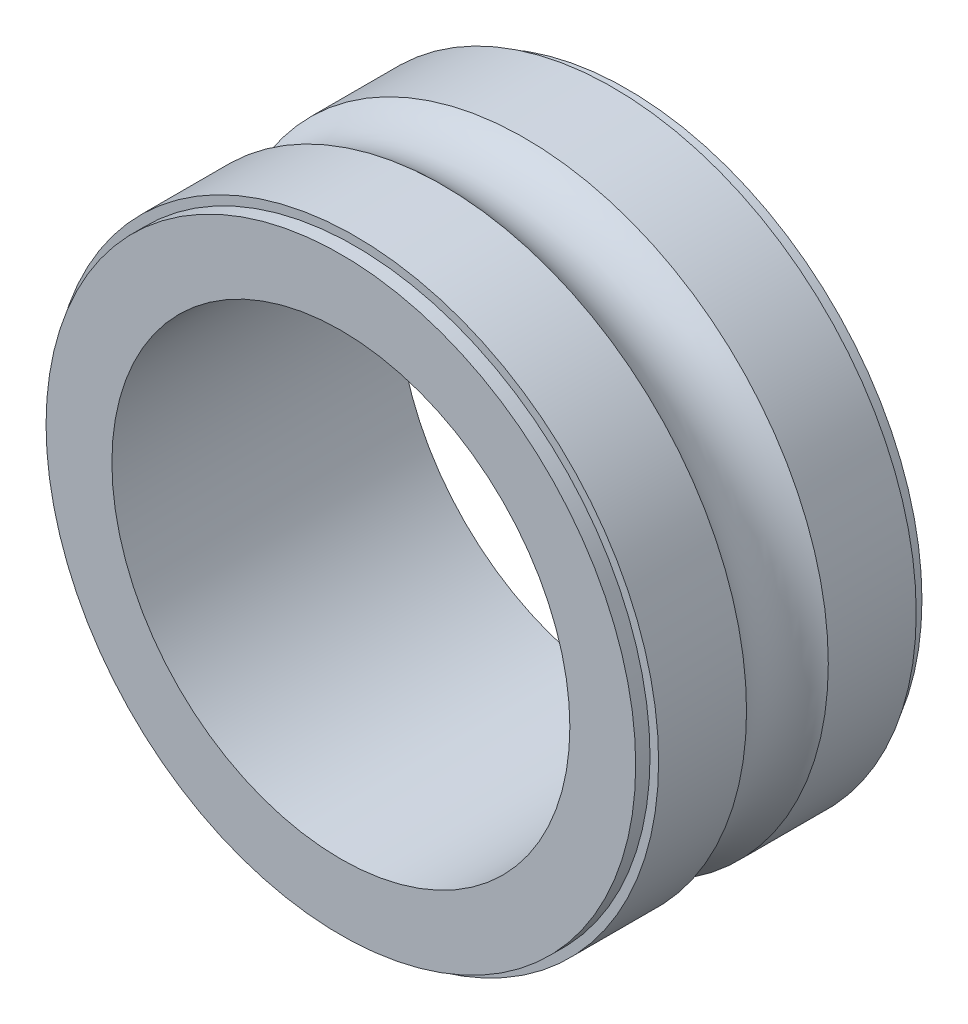
ISO-10303-21;
HEADER;
FILE_DESCRIPTION(('STEP AP214'),'2;1');
FILE_NAME('part.step','',(''),(''),'','','');
FILE_SCHEMA(('AUTOMOTIVE_DESIGN { 1 0 10303 214 1 1 1 1 }'));
ENDSEC;
DATA;
#1=APPLICATION_CONTEXT('core data for automotive mechanical design processes');
#2=APPLICATION_PROTOCOL_DEFINITION('international standard','automotive_design',2000,#1);
#3=PRODUCT_CONTEXT('',#1,'mechanical');
#4=PRODUCT('Part','Part','',(#3));
#5=PRODUCT_RELATED_PRODUCT_CATEGORY('part','',(#4));
#6=PRODUCT_DEFINITION_FORMATION('','',#4);
#7=PRODUCT_DEFINITION_CONTEXT('part definition',#1,'design');
#8=PRODUCT_DEFINITION('design','',#6,#7);
#9=PRODUCT_DEFINITION_SHAPE('','',#8);
#10=(LENGTH_UNIT() NAMED_UNIT(*) SI_UNIT(.MILLI.,.METRE.));
#11=(NAMED_UNIT(*) PLANE_ANGLE_UNIT() SI_UNIT($,.RADIAN.));
#12=(NAMED_UNIT(*) SI_UNIT($,.STERADIAN.) SOLID_ANGLE_UNIT());
#13=UNCERTAINTY_MEASURE_WITH_UNIT(LENGTH_MEASURE(1.E-05),#10,'distance_accuracy_value','');
#14=(GEOMETRIC_REPRESENTATION_CONTEXT(3) GLOBAL_UNCERTAINTY_ASSIGNED_CONTEXT((#13)) GLOBAL_UNIT_ASSIGNED_CONTEXT((#10,
#11,#12)) REPRESENTATION_CONTEXT('',''));
#15=CARTESIAN_POINT('',(0.,0.,0.));
#16=DIRECTION('',(0.,0.,1.));
#17=DIRECTION('',(1.,0.,0.));
#18=AXIS2_PLACEMENT_3D('',#15,#16,#17);
#19=CARTESIAN_POINT('',(0.,0.,6.75539907110854));
#20=DIRECTION('',(0.,0.,1.));
#21=DIRECTION('',(1.,0.,0.));
#22=AXIS2_PLACEMENT_3D('',#19,#20,#21);
#23=CYLINDRICAL_SURFACE('',#22,4.);
#24=CARTESIAN_POINT('',(0.,0.,-2.5));
#25=DIRECTION('',(0.,0.,1.));
#26=DIRECTION('',(1.,0.,0.));
#27=AXIS2_PLACEMENT_3D('',#24,#25,#26);
#28=CIRCLE('',#27,4.);
#29=CARTESIAN_POINT('',(4.,0.,-2.5));
#30=VERTEX_POINT('',#29);
#31=EDGE_CURVE('E10',#30,#30,#28,.T.);
#32=ORIENTED_EDGE('',*,*,#31,.F.);
#33=EDGE_LOOP('',(#32));
#34=FACE_BOUND('',#33,.T.);
#35=CARTESIAN_POINT('',(0.,0.,2.5));
#36=DIRECTION('',(0.,0.,1.));
#37=DIRECTION('',(1.,0.,0.));
#38=AXIS2_PLACEMENT_3D('',#35,#36,#37);
#39=CIRCLE('',#38,4.);
#40=CARTESIAN_POINT('',(4.,0.,2.5));
#41=VERTEX_POINT('',#40);
#42=EDGE_CURVE('E66',#41,#41,#39,.T.);
#43=ORIENTED_EDGE('',*,*,#42,.T.);
#44=EDGE_LOOP('',(#43));
#45=FACE_BOUND('',#44,.T.);
#46=ADVANCED_FACE('F32',(#34,#45),#23,.F.);
#47=CARTESIAN_POINT('',(0.,5.15,-2.5));
#48=DIRECTION('',(0.,0.,1.));
#49=DIRECTION('',(1.,0.,0.));
#50=AXIS2_PLACEMENT_3D('',#47,#48,#49);
#51=PLANE('',#50);
#52=CARTESIAN_POINT('',(0.,0.,-2.5));
#53=DIRECTION('',(0.,0.,1.));
#54=DIRECTION('',(1.,0.,0.));
#55=AXIS2_PLACEMENT_3D('',#52,#53,#54);
#56=CIRCLE('',#55,5.15);
#57=CARTESIAN_POINT('',(5.15,0.,-2.5));
#58=VERTEX_POINT('',#57);
#59=EDGE_CURVE('E38',#58,#58,#56,.T.);
#60=ORIENTED_EDGE('',*,*,#59,.F.);
#61=EDGE_LOOP('',(#60));
#62=FACE_BOUND('',#61,.T.);
#63=ORIENTED_EDGE('',*,*,#31,.T.);
#64=EDGE_LOOP('',(#63));
#65=FACE_BOUND('',#64,.T.);
#66=ADVANCED_FACE('F115',(#62,#65),#51,.F.);
#67=CARTESIAN_POINT('',(0.,0.,6.75539907110854));
#68=DIRECTION('',(0.,0.,1.));
#69=DIRECTION('',(1.,0.,0.));
#70=AXIS2_PLACEMENT_3D('',#67,#68,#69);
#71=CYLINDRICAL_SURFACE('',#70,5.15);
#72=CARTESIAN_POINT('',(0.,0.,-2.25000000000001));
#73=DIRECTION('',(0.,0.,1.));
#74=DIRECTION('',(1.,0.,0.));
#75=AXIS2_PLACEMENT_3D('',#72,#73,#74);
#76=CIRCLE('',#75,5.15);
#77=CARTESIAN_POINT('',(5.15,0.,-2.25000000000001));
#78=VERTEX_POINT('',#77);
#79=EDGE_CURVE('E42',#78,#78,#76,.T.);
#80=ORIENTED_EDGE('',*,*,#79,.F.);
#81=EDGE_LOOP('',(#80));
#82=FACE_BOUND('',#81,.T.);
#83=ORIENTED_EDGE('',*,*,#59,.T.);
#84=EDGE_LOOP('',(#83));
#85=FACE_BOUND('',#84,.T.);
#86=ADVANCED_FACE('F110',(#82,#85),#71,.T.);
#87=CARTESIAN_POINT('',(0.,5.3,-2.25000000000001));
#88=DIRECTION('',(0.,0.,1.));
#89=DIRECTION('',(1.,0.,0.));
#90=AXIS2_PLACEMENT_3D('',#87,#88,#89);
#91=PLANE('',#90);
#92=CARTESIAN_POINT('',(0.,0.,-2.25000000000001));
#93=DIRECTION('',(0.,0.,1.));
#94=DIRECTION('',(1.,0.,0.));
#95=AXIS2_PLACEMENT_3D('',#92,#93,#94);
#96=CIRCLE('',#95,5.3);
#97=CARTESIAN_POINT('',(5.3,0.,-2.25000000000001));
#98=VERTEX_POINT('',#97);
#99=EDGE_CURVE('E46',#98,#98,#96,.T.);
#100=ORIENTED_EDGE('',*,*,#99,.F.);
#101=EDGE_LOOP('',(#100));
#102=FACE_BOUND('',#101,.T.);
#103=ORIENTED_EDGE('',*,*,#79,.T.);
#104=EDGE_LOOP('',(#103));
#105=FACE_BOUND('',#104,.T.);
#106=ADVANCED_FACE('F104',(#102,#105),#91,.F.);
#107=CARTESIAN_POINT('',(0.,0.,6.75539907110854));
#108=DIRECTION('',(0.,0.,1.));
#109=DIRECTION('',(1.,0.,0.));
#110=AXIS2_PLACEMENT_3D('',#107,#108,#109);
#111=CYLINDRICAL_SURFACE('',#110,5.3);
#112=CARTESIAN_POINT('',(0.,0.,-0.714142842854286));
#113=DIRECTION('',(0.,0.,1.));
#114=DIRECTION('',(1.,0.,0.));
#115=AXIS2_PLACEMENT_3D('',#112,#113,#114);
#116=CIRCLE('',#115,5.3);
#117=CARTESIAN_POINT('',(5.3,0.,-0.714142842854286));
#118=VERTEX_POINT('',#117);
#119=EDGE_CURVE('E51',#118,#118,#116,.T.);
#120=ORIENTED_EDGE('',*,*,#119,.F.);
#121=EDGE_LOOP('',(#120));
#122=FACE_BOUND('',#121,.T.);
#123=ORIENTED_EDGE('',*,*,#99,.T.);
#124=EDGE_LOOP('',(#123));
#125=FACE_BOUND('',#124,.T.);
#126=ADVANCED_FACE('F98',(#122,#125),#111,.T.);
#127=CARTESIAN_POINT('',(0.,0.,0.));
#128=DIRECTION('',(0.,0.,1.));
#129=DIRECTION('',(1.,0.,0.));
#130=AXIS2_PLACEMENT_3D('',#127,#128,#129);
#131=TOROIDAL_SURFACE('',#130,6.,1.);
#132=CARTESIAN_POINT('',(0.,0.,0.714142842854288));
#133=DIRECTION('',(0.,0.,1.));
#134=DIRECTION('',(1.,0.,0.));
#135=AXIS2_PLACEMENT_3D('',#132,#133,#134);
#136=CIRCLE('',#135,5.3);
#137=CARTESIAN_POINT('',(5.3,0.,0.714142842854288));
#138=VERTEX_POINT('',#137);
#139=EDGE_CURVE('E54',#138,#138,#136,.T.);
#140=ORIENTED_EDGE('',*,*,#139,.F.);
#141=EDGE_LOOP('',(#140));
#142=FACE_BOUND('',#141,.T.);
#143=ORIENTED_EDGE('',*,*,#119,.T.);
#144=EDGE_LOOP('',(#143));
#145=FACE_BOUND('',#144,.T.);
#146=ADVANCED_FACE('F92',(#142,#145),#131,.F.);
#147=CARTESIAN_POINT('',(0.,0.,6.75539907110854));
#148=DIRECTION('',(0.,0.,1.));
#149=DIRECTION('',(1.,0.,0.));
#150=AXIS2_PLACEMENT_3D('',#147,#148,#149);
#151=CYLINDRICAL_SURFACE('',#150,5.3);
#152=CARTESIAN_POINT('',(0.,0.,2.25000000000001));
#153=DIRECTION('',(0.,0.,1.));
#154=DIRECTION('',(1.,0.,0.));
#155=AXIS2_PLACEMENT_3D('',#152,#153,#154);
#156=CIRCLE('',#155,5.3);
#157=CARTESIAN_POINT('',(5.3,0.,2.25000000000001));
#158=VERTEX_POINT('',#157);
#159=EDGE_CURVE('E57',#158,#158,#156,.T.);
#160=ORIENTED_EDGE('',*,*,#159,.F.);
#161=EDGE_LOOP('',(#160));
#162=FACE_BOUND('',#161,.T.);
#163=ORIENTED_EDGE('',*,*,#139,.T.);
#164=EDGE_LOOP('',(#163));
#165=FACE_BOUND('',#164,.T.);
#166=ADVANCED_FACE('F86',(#162,#165),#151,.T.);
#167=CARTESIAN_POINT('',(0.,5.3,2.25000000000001));
#168=DIRECTION('',(0.,0.,-1.));
#169=DIRECTION('',(-1.,0.,0.));
#170=AXIS2_PLACEMENT_3D('',#167,#168,#169);
#171=PLANE('',#170);
#172=CARTESIAN_POINT('',(0.,0.,2.25000000000001));
#173=DIRECTION('',(0.,0.,1.));
#174=DIRECTION('',(1.,0.,0.));
#175=AXIS2_PLACEMENT_3D('',#172,#173,#174);
#176=CIRCLE('',#175,5.15);
#177=CARTESIAN_POINT('',(5.15,0.,2.25000000000001));
#178=VERTEX_POINT('',#177);
#179=EDGE_CURVE('E60',#178,#178,#176,.T.);
#180=ORIENTED_EDGE('',*,*,#179,.F.);
#181=EDGE_LOOP('',(#180));
#182=FACE_BOUND('',#181,.T.);
#183=ORIENTED_EDGE('',*,*,#159,.T.);
#184=EDGE_LOOP('',(#183));
#185=FACE_BOUND('',#184,.T.);
#186=ADVANCED_FACE('F80',(#182,#185),#171,.F.);
#187=CARTESIAN_POINT('',(0.,0.,6.75539907110854));
#188=DIRECTION('',(0.,0.,1.));
#189=DIRECTION('',(1.,0.,0.));
#190=AXIS2_PLACEMENT_3D('',#187,#188,#189);
#191=CYLINDRICAL_SURFACE('',#190,5.15);
#192=CARTESIAN_POINT('',(0.,0.,2.5));
#193=DIRECTION('',(0.,0.,1.));
#194=DIRECTION('',(1.,0.,0.));
#195=AXIS2_PLACEMENT_3D('',#192,#193,#194);
#196=CIRCLE('',#195,5.15);
#197=CARTESIAN_POINT('',(5.15,0.,2.5));
#198=VERTEX_POINT('',#197);
#199=EDGE_CURVE('E63',#198,#198,#196,.T.);
#200=ORIENTED_EDGE('',*,*,#199,.F.);
#201=EDGE_LOOP('',(#200));
#202=FACE_BOUND('',#201,.T.);
#203=ORIENTED_EDGE('',*,*,#179,.T.);
#204=EDGE_LOOP('',(#203));
#205=FACE_BOUND('',#204,.T.);
#206=ADVANCED_FACE('F74',(#202,#205),#191,.T.);
#207=CARTESIAN_POINT('',(0.,5.15,2.5));
#208=DIRECTION('',(0.,0.,-1.));
#209=DIRECTION('',(-1.,0.,0.));
#210=AXIS2_PLACEMENT_3D('',#207,#208,#209);
#211=PLANE('',#210);
#212=ORIENTED_EDGE('',*,*,#42,.F.);
#213=EDGE_LOOP('',(#212));
#214=FACE_BOUND('',#213,.T.);
#215=ORIENTED_EDGE('',*,*,#199,.T.);
#216=EDGE_LOOP('',(#215));
#217=FACE_BOUND('',#216,.T.);
#218=ADVANCED_FACE('F71',(#214,#217),#211,.F.);
#219=CLOSED_SHELL('',(#46,#66,#86,#106,#126,#146,#166,#186,#206,#218));
#220=MANIFOLD_SOLID_BREP('B2',#219);
#221=ADVANCED_BREP_SHAPE_REPRESENTATION('',(#18,#220),#14);
#222=SHAPE_DEFINITION_REPRESENTATION(#9,#221);
ENDSEC;
END-ISO-10303-21;
